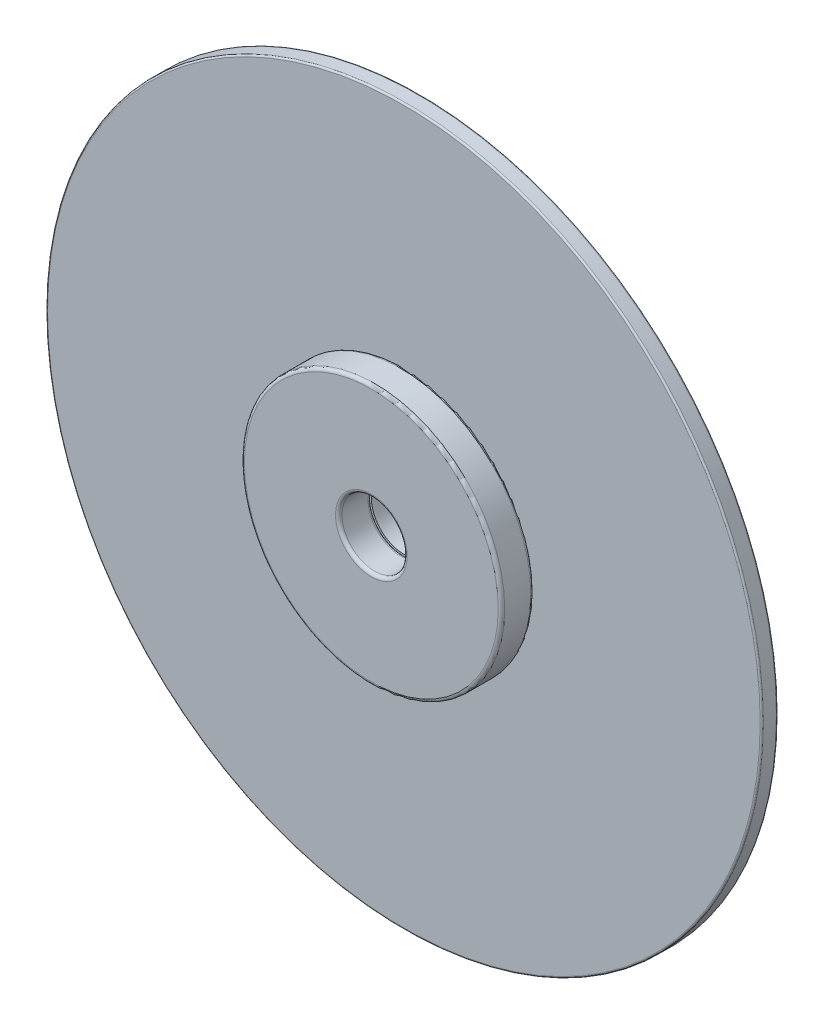
ISO-10303-21;
HEADER;
FILE_DESCRIPTION(('STEP AP214'),'2;1');
FILE_NAME('part.step','',(''),(''),'','','');
FILE_SCHEMA(('AUTOMOTIVE_DESIGN { 1 0 10303 214 1 1 1 1 }'));
ENDSEC;
DATA;
#1=APPLICATION_CONTEXT('core data for automotive mechanical design processes');
#2=APPLICATION_PROTOCOL_DEFINITION('international standard','automotive_design',2000,#1);
#3=PRODUCT_CONTEXT('',#1,'mechanical');
#4=PRODUCT('Part','Part','',(#3));
#5=PRODUCT_RELATED_PRODUCT_CATEGORY('part','',(#4));
#6=PRODUCT_DEFINITION_FORMATION('','',#4);
#7=PRODUCT_DEFINITION_CONTEXT('part definition',#1,'design');
#8=PRODUCT_DEFINITION('design','',#6,#7);
#9=PRODUCT_DEFINITION_SHAPE('','',#8);
#10=(LENGTH_UNIT() NAMED_UNIT(*) SI_UNIT(.MILLI.,.METRE.));
#11=(NAMED_UNIT(*) PLANE_ANGLE_UNIT() SI_UNIT($,.RADIAN.));
#12=(NAMED_UNIT(*) SI_UNIT($,.STERADIAN.) SOLID_ANGLE_UNIT());
#13=UNCERTAINTY_MEASURE_WITH_UNIT(LENGTH_MEASURE(1.E-05),#10,'distance_accuracy_value','');
#14=(GEOMETRIC_REPRESENTATION_CONTEXT(3) GLOBAL_UNCERTAINTY_ASSIGNED_CONTEXT((#13)) GLOBAL_UNIT_ASSIGNED_CONTEXT((#10,
#11,#12)) REPRESENTATION_CONTEXT('',''));
#15=CARTESIAN_POINT('',(0.,0.,0.));
#16=DIRECTION('',(0.,0.,1.));
#17=DIRECTION('',(1.,0.,0.));
#18=AXIS2_PLACEMENT_3D('',#15,#16,#17);
#19=CARTESIAN_POINT('',(0.,0.,-1.));
#20=DIRECTION('',(0.,0.,-1.));
#21=DIRECTION('',(-1.,0.,0.));
#22=AXIS2_PLACEMENT_3D('',#19,#20,#21);
#23=PLANE('',#22);
#24=CARTESIAN_POINT('',(0.,0.,-1.));
#25=DIRECTION('',(0.,0.,-1.));
#26=DIRECTION('',(-1.,0.,0.));
#27=AXIS2_PLACEMENT_3D('',#24,#25,#26);
#28=CIRCLE('',#27,1.1);
#29=CARTESIAN_POINT('',(-1.1,0.,-1.));
#30=VERTEX_POINT('',#29);
#31=EDGE_CURVE('E56',#30,#30,#28,.F.);
#32=ORIENTED_EDGE('',*,*,#31,.T.);
#33=EDGE_LOOP('',(#32));
#34=FACE_BOUND('',#33,.T.);
#35=CARTESIAN_POINT('',(0.,0.,-1.));
#36=DIRECTION('',(0.,0.,-1.));
#37=DIRECTION('',(-1.,0.,0.));
#38=AXIS2_PLACEMENT_3D('',#35,#36,#37);
#39=CIRCLE('',#38,3.9);
#40=CARTESIAN_POINT('',(-3.9,0.,-1.));
#41=VERTEX_POINT('',#40);
#42=EDGE_CURVE('E61',#41,#41,#39,.T.);
#43=ORIENTED_EDGE('',*,*,#42,.T.);
#44=EDGE_LOOP('',(#43));
#45=FACE_BOUND('',#44,.T.);
#46=ADVANCED_FACE('F41',(#34,#45),#23,.T.);
#47=CARTESIAN_POINT('',(0.,0.,0.));
#48=DIRECTION('',(0.,0.,-1.));
#49=DIRECTION('',(-1.,0.,0.));
#50=AXIS2_PLACEMENT_3D('',#47,#48,#49);
#51=PLANE('',#50);
#52=CARTESIAN_POINT('',(0.,0.,0.));
#53=DIRECTION('',(0.,0.,-1.));
#54=DIRECTION('',(-1.,0.,0.));
#55=AXIS2_PLACEMENT_3D('',#52,#53,#54);
#56=CIRCLE('',#55,3.9);
#57=CARTESIAN_POINT('',(-3.9,0.,0.));
#58=VERTEX_POINT('',#57);
#59=EDGE_CURVE('E11',#58,#58,#56,.F.);
#60=ORIENTED_EDGE('',*,*,#59,.T.);
#61=EDGE_LOOP('',(#60));
#62=FACE_BOUND('',#61,.T.);
#63=CARTESIAN_POINT('',(0.,0.,0.));
#64=DIRECTION('',(0.,0.,-1.));
#65=DIRECTION('',(-1.,0.,0.));
#66=AXIS2_PLACEMENT_3D('',#63,#64,#65);
#67=CIRCLE('',#66,1.);
#68=CARTESIAN_POINT('',(-1.,0.,0.));
#69=VERTEX_POINT('',#68);
#70=EDGE_CURVE('E67',#69,#69,#67,.T.);
#71=ORIENTED_EDGE('',*,*,#70,.T.);
#72=EDGE_LOOP('',(#71));
#73=FACE_BOUND('',#72,.T.);
#74=ADVANCED_FACE('F71',(#62,#73),#51,.F.);
#75=CARTESIAN_POINT('',(0.,0.,-1.));
#76=DIRECTION('',(0.,0.,1.));
#77=DIRECTION('',(1.,0.,0.));
#78=AXIS2_PLACEMENT_3D('',#75,#76,#77);
#79=CYLINDRICAL_SURFACE('',#78,4.);
#80=CARTESIAN_POINT('',(0.,0.,-0.1));
#81=DIRECTION('',(0.,0.,-1.));
#82=DIRECTION('',(-1.,0.,0.));
#83=AXIS2_PLACEMENT_3D('',#80,#81,#82);
#84=CIRCLE('',#83,4.);
#85=CARTESIAN_POINT('',(-4.,0.,-0.1));
#86=VERTEX_POINT('',#85);
#87=EDGE_CURVE('E48',#86,#86,#84,.T.);
#88=ORIENTED_EDGE('',*,*,#87,.T.);
#89=EDGE_LOOP('',(#88));
#90=FACE_BOUND('',#89,.T.);
#91=CARTESIAN_POINT('',(0.,0.,-0.9));
#92=DIRECTION('',(0.,0.,-1.));
#93=DIRECTION('',(-1.,0.,0.));
#94=AXIS2_PLACEMENT_3D('',#91,#92,#93);
#95=CIRCLE('',#94,4.);
#96=CARTESIAN_POINT('',(-4.,0.,-0.9));
#97=VERTEX_POINT('',#96);
#98=EDGE_CURVE('E52',#97,#97,#95,.F.);
#99=ORIENTED_EDGE('',*,*,#98,.T.);
#100=EDGE_LOOP('',(#99));
#101=FACE_BOUND('',#100,.T.);
#102=ADVANCED_FACE('F76',(#90,#101),#79,.T.);
#103=CARTESIAN_POINT('',(0.,0.,-1.));
#104=DIRECTION('',(0.,0.,1.));
#105=DIRECTION('',(1.,0.,0.));
#106=AXIS2_PLACEMENT_3D('',#103,#104,#105);
#107=CYLINDRICAL_SURFACE('',#106,1.);
#108=CARTESIAN_POINT('',(0.,0.,-0.9));
#109=DIRECTION('',(0.,0.,-1.));
#110=DIRECTION('',(-1.,0.,0.));
#111=AXIS2_PLACEMENT_3D('',#108,#109,#110);
#112=CIRCLE('',#111,1.);
#113=CARTESIAN_POINT('',(-1.,0.,-0.9));
#114=VERTEX_POINT('',#113);
#115=EDGE_CURVE('E64',#114,#114,#112,.T.);
#116=ORIENTED_EDGE('',*,*,#115,.T.);
#117=EDGE_LOOP('',(#116));
#118=FACE_BOUND('',#117,.T.);
#119=ORIENTED_EDGE('',*,*,#70,.F.);
#120=EDGE_LOOP('',(#119));
#121=FACE_BOUND('',#120,.T.);
#122=ADVANCED_FACE('F73',(#118,#121),#107,.F.);
#123=CARTESIAN_POINT('',(0.,0.,-0.9));
#124=DIRECTION('',(0.,0.,-1.));
#125=DIRECTION('',(-1.,0.,0.));
#126=AXIS2_PLACEMENT_3D('',#123,#124,#125);
#127=TOROIDAL_SURFACE('',#126,1.1,0.1);
#128=ORIENTED_EDGE('',*,*,#31,.F.);
#129=EDGE_LOOP('',(#128));
#130=FACE_BOUND('',#129,.T.);
#131=ORIENTED_EDGE('',*,*,#115,.F.);
#132=EDGE_LOOP('',(#131));
#133=FACE_BOUND('',#132,.T.);
#134=ADVANCED_FACE('F75',(#130,#133),#127,.T.);
#135=CARTESIAN_POINT('',(0.,0.,-0.1));
#136=DIRECTION('',(0.,0.,-1.));
#137=DIRECTION('',(-1.,0.,0.));
#138=AXIS2_PLACEMENT_3D('',#135,#136,#137);
#139=TOROIDAL_SURFACE('',#138,3.9,0.1);
#140=ORIENTED_EDGE('',*,*,#59,.F.);
#141=EDGE_LOOP('',(#140));
#142=FACE_BOUND('',#141,.T.);
#143=ORIENTED_EDGE('',*,*,#87,.F.);
#144=EDGE_LOOP('',(#143));
#145=FACE_BOUND('',#144,.T.);
#146=ADVANCED_FACE('F83',(#142,#145),#139,.T.);
#147=CARTESIAN_POINT('',(0.,0.,-0.9));
#148=DIRECTION('',(0.,0.,-1.));
#149=DIRECTION('',(-1.,0.,0.));
#150=AXIS2_PLACEMENT_3D('',#147,#148,#149);
#151=TOROIDAL_SURFACE('',#150,3.9,0.1);
#152=ORIENTED_EDGE('',*,*,#98,.F.);
#153=EDGE_LOOP('',(#152));
#154=FACE_BOUND('',#153,.T.);
#155=ORIENTED_EDGE('',*,*,#42,.F.);
#156=EDGE_LOOP('',(#155));
#157=FACE_BOUND('',#156,.T.);
#158=ADVANCED_FACE('F43',(#154,#157),#151,.T.);
#159=CLOSED_SHELL('',(#46,#74,#102,#122,#134,#146,#158));
#160=MANIFOLD_SOLID_BREP('B2',#159);
#161=CARTESIAN_POINT('',(0.,0.,1.5));
#162=DIRECTION('',(0.,0.,1.));
#163=DIRECTION('',(1.,0.,0.));
#164=AXIS2_PLACEMENT_3D('',#161,#162,#163);
#165=PLANE('',#164);
#166=CARTESIAN_POINT('',(0.,0.,1.5));
#167=DIRECTION('',(0.,0.,1.));
#168=DIRECTION('',(1.,0.,0.));
#169=AXIS2_PLACEMENT_3D('',#166,#167,#168);
#170=CIRCLE('',#169,1.1);
#171=CARTESIAN_POINT('',(1.1,0.,1.5));
#172=VERTEX_POINT('',#171);
#173=EDGE_CURVE('E40',#172,#172,#170,.F.);
#174=ORIENTED_EDGE('',*,*,#173,.T.);
#175=EDGE_LOOP('',(#174));
#176=FACE_BOUND('',#175,.T.);
#177=CARTESIAN_POINT('',(0.,0.,1.5));
#178=DIRECTION('',(0.,0.,1.));
#179=DIRECTION('',(1.,0.,0.));
#180=AXIS2_PLACEMENT_3D('',#177,#178,#179);
#181=CIRCLE('',#180,3.9);
#182=CARTESIAN_POINT('',(3.9,0.,1.5));
#183=VERTEX_POINT('',#182);
#184=EDGE_CURVE('E161',#183,#183,#181,.T.);
#185=ORIENTED_EDGE('',*,*,#184,.T.);
#186=EDGE_LOOP('',(#185));
#187=FACE_BOUND('',#186,.T.);
#188=ADVANCED_FACE('F154',(#176,#187),#165,.T.);
#189=CARTESIAN_POINT('',(0.,0.,0.5));
#190=DIRECTION('',(0.,0.,1.));
#191=DIRECTION('',(1.,0.,0.));
#192=AXIS2_PLACEMENT_3D('',#189,#190,#191);
#193=PLANE('',#192);
#194=CARTESIAN_POINT('',(0.,0.,0.5));
#195=DIRECTION('',(0.,0.,1.));
#196=DIRECTION('',(1.,0.,0.));
#197=AXIS2_PLACEMENT_3D('',#194,#195,#196);
#198=CIRCLE('',#197,1.1);
#199=CARTESIAN_POINT('',(1.1,0.,0.5));
#200=VERTEX_POINT('',#199);
#201=EDGE_CURVE('E180',#200,#200,#198,.T.);
#202=ORIENTED_EDGE('',*,*,#201,.T.);
#203=EDGE_LOOP('',(#202));
#204=FACE_BOUND('',#203,.T.);
#205=CARTESIAN_POINT('',(0.,0.,0.5));
#206=DIRECTION('',(0.,0.,1.));
#207=DIRECTION('',(1.,0.,0.));
#208=AXIS2_PLACEMENT_3D('',#205,#206,#207);
#209=CIRCLE('',#208,3.9);
#210=CARTESIAN_POINT('',(3.9,0.,0.5));
#211=VERTEX_POINT('',#210);
#212=EDGE_CURVE('E183',#211,#211,#209,.F.);
#213=ORIENTED_EDGE('',*,*,#212,.T.);
#214=EDGE_LOOP('',(#213));
#215=FACE_BOUND('',#214,.T.);
#216=ADVANCED_FACE('F187',(#204,#215),#193,.F.);
#217=CARTESIAN_POINT('',(0.,0.,1.5));
#218=DIRECTION('',(0.,0.,-1.));
#219=DIRECTION('',(-1.,0.,0.));
#220=AXIS2_PLACEMENT_3D('',#217,#218,#219);
#221=CYLINDRICAL_SURFACE('',#220,4.);
#222=CARTESIAN_POINT('',(0.,0.,0.6));
#223=DIRECTION('',(0.,0.,1.));
#224=DIRECTION('',(1.,0.,0.));
#225=AXIS2_PLACEMENT_3D('',#222,#223,#224);
#226=CIRCLE('',#225,4.);
#227=CARTESIAN_POINT('',(4.,0.,0.6));
#228=VERTEX_POINT('',#227);
#229=EDGE_CURVE('E165',#228,#228,#226,.T.);
#230=ORIENTED_EDGE('',*,*,#229,.T.);
#231=EDGE_LOOP('',(#230));
#232=FACE_BOUND('',#231,.T.);
#233=CARTESIAN_POINT('',(0.,0.,1.4));
#234=DIRECTION('',(0.,0.,1.));
#235=DIRECTION('',(1.,0.,0.));
#236=AXIS2_PLACEMENT_3D('',#233,#234,#235);
#237=CIRCLE('',#236,4.);
#238=CARTESIAN_POINT('',(4.,0.,1.4));
#239=VERTEX_POINT('',#238);
#240=EDGE_CURVE('E169',#239,#239,#237,.F.);
#241=ORIENTED_EDGE('',*,*,#240,.T.);
#242=EDGE_LOOP('',(#241));
#243=FACE_BOUND('',#242,.T.);
#244=ADVANCED_FACE('F197',(#232,#243),#221,.T.);
#245=CARTESIAN_POINT('',(0.,0.,1.5));
#246=DIRECTION('',(0.,0.,-1.));
#247=DIRECTION('',(-1.,0.,0.));
#248=AXIS2_PLACEMENT_3D('',#245,#246,#247);
#249=CYLINDRICAL_SURFACE('',#248,1.);
#250=CARTESIAN_POINT('',(0.,0.,0.6));
#251=DIRECTION('',(0.,0.,1.));
#252=DIRECTION('',(1.,0.,0.));
#253=AXIS2_PLACEMENT_3D('',#250,#251,#252);
#254=CIRCLE('',#253,1.);
#255=CARTESIAN_POINT('',(1.,0.,0.6));
#256=VERTEX_POINT('',#255);
#257=EDGE_CURVE('E174',#256,#256,#254,.F.);
#258=ORIENTED_EDGE('',*,*,#257,.T.);
#259=EDGE_LOOP('',(#258));
#260=FACE_BOUND('',#259,.T.);
#261=CARTESIAN_POINT('',(0.,0.,1.4));
#262=DIRECTION('',(0.,0.,1.));
#263=DIRECTION('',(1.,0.,0.));
#264=AXIS2_PLACEMENT_3D('',#261,#262,#263);
#265=CIRCLE('',#264,1.);
#266=CARTESIAN_POINT('',(1.,0.,1.4));
#267=VERTEX_POINT('',#266);
#268=EDGE_CURVE('E177',#267,#267,#265,.T.);
#269=ORIENTED_EDGE('',*,*,#268,.T.);
#270=EDGE_LOOP('',(#269));
#271=FACE_BOUND('',#270,.T.);
#272=ADVANCED_FACE('F200',(#260,#271),#249,.F.);
#273=CARTESIAN_POINT('',(0.,0.,0.6));
#274=DIRECTION('',(0.,0.,1.));
#275=DIRECTION('',(1.,0.,0.));
#276=AXIS2_PLACEMENT_3D('',#273,#274,#275);
#277=TOROIDAL_SURFACE('',#276,1.1,0.1);
#278=ORIENTED_EDGE('',*,*,#257,.F.);
#279=EDGE_LOOP('',(#278));
#280=FACE_BOUND('',#279,.T.);
#281=ORIENTED_EDGE('',*,*,#201,.F.);
#282=EDGE_LOOP('',(#281));
#283=FACE_BOUND('',#282,.T.);
#284=ADVANCED_FACE('F193',(#280,#283),#277,.T.);
#285=CARTESIAN_POINT('',(0.,0.,0.6));
#286=DIRECTION('',(0.,0.,1.));
#287=DIRECTION('',(1.,0.,0.));
#288=AXIS2_PLACEMENT_3D('',#285,#286,#287);
#289=TOROIDAL_SURFACE('',#288,3.9,0.1);
#290=ORIENTED_EDGE('',*,*,#212,.F.);
#291=EDGE_LOOP('',(#290));
#292=FACE_BOUND('',#291,.T.);
#293=ORIENTED_EDGE('',*,*,#229,.F.);
#294=EDGE_LOOP('',(#293));
#295=FACE_BOUND('',#294,.T.);
#296=ADVANCED_FACE('F189',(#292,#295),#289,.T.);
#297=CARTESIAN_POINT('',(0.,0.,1.4));
#298=DIRECTION('',(0.,0.,1.));
#299=DIRECTION('',(1.,0.,0.));
#300=AXIS2_PLACEMENT_3D('',#297,#298,#299);
#301=TOROIDAL_SURFACE('',#300,1.1,0.1);
#302=ORIENTED_EDGE('',*,*,#173,.F.);
#303=EDGE_LOOP('',(#302));
#304=FACE_BOUND('',#303,.T.);
#305=ORIENTED_EDGE('',*,*,#268,.F.);
#306=EDGE_LOOP('',(#305));
#307=FACE_BOUND('',#306,.T.);
#308=ADVANCED_FACE('F192',(#304,#307),#301,.T.);
#309=CARTESIAN_POINT('',(0.,0.,1.4));
#310=DIRECTION('',(0.,0.,1.));
#311=DIRECTION('',(1.,0.,0.));
#312=AXIS2_PLACEMENT_3D('',#309,#310,#311);
#313=TOROIDAL_SURFACE('',#312,3.9,0.1);
#314=ORIENTED_EDGE('',*,*,#240,.F.);
#315=EDGE_LOOP('',(#314));
#316=FACE_BOUND('',#315,.T.);
#317=ORIENTED_EDGE('',*,*,#184,.F.);
#318=EDGE_LOOP('',(#317));
#319=FACE_BOUND('',#318,.T.);
#320=ADVANCED_FACE('F156',(#316,#319),#313,.T.);
#321=CLOSED_SHELL('',(#188,#216,#244,#272,#284,#296,#308,#320));
#322=MANIFOLD_SOLID_BREP('B6',#321);
#323=CARTESIAN_POINT('',(0.,0.,0.5));
#324=DIRECTION('',(0.,0.,1.));
#325=DIRECTION('',(1.,0.,0.));
#326=AXIS2_PLACEMENT_3D('',#323,#324,#325);
#327=PLANE('',#326);
#328=CARTESIAN_POINT('',(0.,0.,0.5));
#329=DIRECTION('',(0.,0.,1.));
#330=DIRECTION('',(1.,0.,0.));
#331=AXIS2_PLACEMENT_3D('',#328,#329,#330);
#332=CIRCLE('',#331,10.95);
#333=CARTESIAN_POINT('',(10.95,0.,0.5));
#334=VERTEX_POINT('',#333);
#335=EDGE_CURVE('E153',#334,#334,#332,.T.);
#336=ORIENTED_EDGE('',*,*,#335,.T.);
#337=EDGE_LOOP('',(#336));
#338=FACE_BOUND('',#337,.T.);
#339=CARTESIAN_POINT('',(0.,0.,0.5));
#340=DIRECTION('',(0.,0.,1.));
#341=DIRECTION('',(1.,0.,0.));
#342=AXIS2_PLACEMENT_3D('',#339,#340,#341);
#343=CIRCLE('',#342,1.);
#344=CARTESIAN_POINT('',(1.,0.,0.5));
#345=VERTEX_POINT('',#344);
#346=EDGE_CURVE('E295',#345,#345,#343,.T.);
#347=ORIENTED_EDGE('',*,*,#346,.F.);
#348=EDGE_LOOP('',(#347));
#349=FACE_BOUND('',#348,.T.);
#350=ADVANCED_FACE('F275',(#338,#349),#327,.T.);
#351=CARTESIAN_POINT('',(0.,0.,0.));
#352=DIRECTION('',(0.,0.,1.));
#353=DIRECTION('',(1.,0.,0.));
#354=AXIS2_PLACEMENT_3D('',#351,#352,#353);
#355=PLANE('',#354);
#356=CARTESIAN_POINT('',(0.,0.,0.));
#357=DIRECTION('',(0.,0.,1.));
#358=DIRECTION('',(1.,0.,0.));
#359=AXIS2_PLACEMENT_3D('',#356,#357,#358);
#360=CIRCLE('',#359,10.95);
#361=CARTESIAN_POINT('',(10.95,0.,0.));
#362=VERTEX_POINT('',#361);
#363=EDGE_CURVE('E282',#362,#362,#360,.F.);
#364=ORIENTED_EDGE('',*,*,#363,.T.);
#365=EDGE_LOOP('',(#364));
#366=FACE_BOUND('',#365,.T.);
#367=CARTESIAN_POINT('',(0.,0.,0.));
#368=DIRECTION('',(0.,0.,1.));
#369=DIRECTION('',(1.,0.,0.));
#370=AXIS2_PLACEMENT_3D('',#367,#368,#369);
#371=CIRCLE('',#370,1.);
#372=CARTESIAN_POINT('',(1.,0.,0.));
#373=VERTEX_POINT('',#372);
#374=EDGE_CURVE('E296',#373,#373,#371,.T.);
#375=ORIENTED_EDGE('',*,*,#374,.T.);
#376=EDGE_LOOP('',(#375));
#377=FACE_BOUND('',#376,.T.);
#378=ADVANCED_FACE('F306',(#366,#377),#355,.F.);
#379=CARTESIAN_POINT('',(0.,0.,0.5));
#380=DIRECTION('',(0.,0.,-1.));
#381=DIRECTION('',(-1.,0.,0.));
#382=AXIS2_PLACEMENT_3D('',#379,#380,#381);
#383=CYLINDRICAL_SURFACE('',#382,11.);
#384=CARTESIAN_POINT('',(0.,0.,0.05));
#385=DIRECTION('',(0.,0.,1.));
#386=DIRECTION('',(1.,0.,0.));
#387=AXIS2_PLACEMENT_3D('',#384,#385,#386);
#388=CIRCLE('',#387,11.);
#389=CARTESIAN_POINT('',(11.,0.,0.05));
#390=VERTEX_POINT('',#389);
#391=EDGE_CURVE('E286',#390,#390,#388,.T.);
#392=ORIENTED_EDGE('',*,*,#391,.T.);
#393=EDGE_LOOP('',(#392));
#394=FACE_BOUND('',#393,.T.);
#395=CARTESIAN_POINT('',(0.,0.,0.45));
#396=DIRECTION('',(0.,0.,1.));
#397=DIRECTION('',(1.,0.,0.));
#398=AXIS2_PLACEMENT_3D('',#395,#396,#397);
#399=CIRCLE('',#398,11.);
#400=CARTESIAN_POINT('',(11.,0.,0.45));
#401=VERTEX_POINT('',#400);
#402=EDGE_CURVE('E290',#401,#401,#399,.F.);
#403=ORIENTED_EDGE('',*,*,#402,.T.);
#404=EDGE_LOOP('',(#403));
#405=FACE_BOUND('',#404,.T.);
#406=ADVANCED_FACE('F311',(#394,#405),#383,.T.);
#407=CARTESIAN_POINT('',(0.,0.,0.5));
#408=DIRECTION('',(0.,0.,-1.));
#409=DIRECTION('',(-1.,0.,0.));
#410=AXIS2_PLACEMENT_3D('',#407,#408,#409);
#411=CYLINDRICAL_SURFACE('',#410,1.);
#412=ORIENTED_EDGE('',*,*,#346,.T.);
#413=EDGE_LOOP('',(#412));
#414=FACE_BOUND('',#413,.T.);
#415=ORIENTED_EDGE('',*,*,#374,.F.);
#416=EDGE_LOOP('',(#415));
#417=FACE_BOUND('',#416,.T.);
#418=ADVANCED_FACE('F302',(#414,#417),#411,.F.);
#419=CARTESIAN_POINT('',(0.,0.,0.05));
#420=DIRECTION('',(0.,0.,1.));
#421=DIRECTION('',(1.,0.,0.));
#422=AXIS2_PLACEMENT_3D('',#419,#420,#421);
#423=TOROIDAL_SURFACE('',#422,10.95,0.05);
#424=ORIENTED_EDGE('',*,*,#363,.F.);
#425=EDGE_LOOP('',(#424));
#426=FACE_BOUND('',#425,.T.);
#427=ORIENTED_EDGE('',*,*,#391,.F.);
#428=EDGE_LOOP('',(#427));
#429=FACE_BOUND('',#428,.T.);
#430=ADVANCED_FACE('F317',(#426,#429),#423,.T.);
#431=CARTESIAN_POINT('',(0.,0.,0.45));
#432=DIRECTION('',(0.,0.,1.));
#433=DIRECTION('',(1.,0.,0.));
#434=AXIS2_PLACEMENT_3D('',#431,#432,#433);
#435=TOROIDAL_SURFACE('',#434,10.95,0.05);
#436=ORIENTED_EDGE('',*,*,#402,.F.);
#437=EDGE_LOOP('',(#436));
#438=FACE_BOUND('',#437,.T.);
#439=ORIENTED_EDGE('',*,*,#335,.F.);
#440=EDGE_LOOP('',(#439));
#441=FACE_BOUND('',#440,.T.);
#442=ADVANCED_FACE('F277',(#438,#441),#435,.T.);
#443=CLOSED_SHELL('',(#350,#378,#406,#418,#430,#442));
#444=MANIFOLD_SOLID_BREP('B35',#443);
#445=ADVANCED_BREP_SHAPE_REPRESENTATION('',(#18,#160,#322,#444),#14);
#446=SHAPE_DEFINITION_REPRESENTATION(#9,#445);
ENDSEC;
END-ISO-10303-21;
